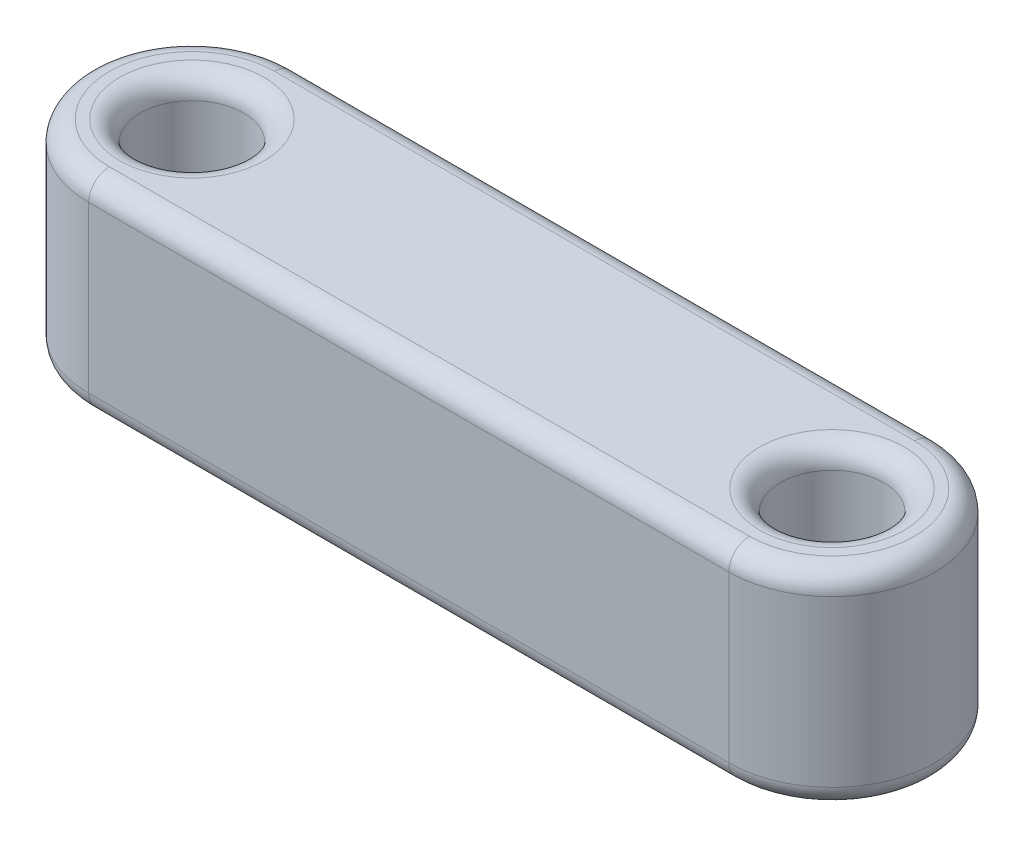
ISO-10303-21;
HEADER;
FILE_DESCRIPTION(('STEP AP214'),'2;1');
FILE_NAME('part.step','',(''),(''),'','','');
FILE_SCHEMA(('AUTOMOTIVE_DESIGN { 1 0 10303 214 1 1 1 1 }'));
ENDSEC;
DATA;
#1=APPLICATION_CONTEXT('core data for automotive mechanical design processes');
#2=APPLICATION_PROTOCOL_DEFINITION('international standard','automotive_design',2000,#1);
#3=PRODUCT_CONTEXT('',#1,'mechanical');
#4=PRODUCT('Part','Part','',(#3));
#5=PRODUCT_RELATED_PRODUCT_CATEGORY('part','',(#4));
#6=PRODUCT_DEFINITION_FORMATION('','',#4);
#7=PRODUCT_DEFINITION_CONTEXT('part definition',#1,'design');
#8=PRODUCT_DEFINITION('design','',#6,#7);
#9=PRODUCT_DEFINITION_SHAPE('','',#8);
#10=(LENGTH_UNIT() NAMED_UNIT(*) SI_UNIT(.MILLI.,.METRE.));
#11=(NAMED_UNIT(*) PLANE_ANGLE_UNIT() SI_UNIT($,.RADIAN.));
#12=(NAMED_UNIT(*) SI_UNIT($,.STERADIAN.) SOLID_ANGLE_UNIT());
#13=UNCERTAINTY_MEASURE_WITH_UNIT(LENGTH_MEASURE(1.E-05),#10,'distance_accuracy_value','');
#14=(GEOMETRIC_REPRESENTATION_CONTEXT(3) GLOBAL_UNCERTAINTY_ASSIGNED_CONTEXT((#13)) GLOBAL_UNIT_ASSIGNED_CONTEXT((#10,
#11,#12)) REPRESENTATION_CONTEXT('',''));
#15=CARTESIAN_POINT('',(0.,0.,0.));
#16=DIRECTION('',(0.,0.,1.));
#17=DIRECTION('',(1.,0.,0.));
#18=AXIS2_PLACEMENT_3D('',#15,#16,#17);
#19=CARTESIAN_POINT('',(0.,10.,0.));
#20=DIRECTION('',(0.,1.,0.));
#21=DIRECTION('',(0.,0.,1.));
#22=AXIS2_PLACEMENT_3D('',#19,#20,#21);
#23=PLANE('',#22);
#24=CARTESIAN_POINT('',(31.,10.,0.));
#25=DIRECTION('',(0.,1.,0.));
#26=DIRECTION('',(0.,0.,1.));
#27=AXIS2_PLACEMENT_3D('',#24,#25,#26);
#28=CIRCLE('',#27,3.5);
#29=CARTESIAN_POINT('',(31.,10.,3.5));
#30=VERTEX_POINT('',#29);
#31=EDGE_CURVE('E11',#30,#30,#28,.F.);
#32=ORIENTED_EDGE('',*,*,#31,.T.);
#33=EDGE_LOOP('',(#32));
#34=FACE_BOUND('',#33,.T.);
#35=CARTESIAN_POINT('',(31.,10.,0.));
#36=DIRECTION('',(0.,1.,0.));
#37=DIRECTION('',(0.,0.,1.));
#38=AXIS2_PLACEMENT_3D('',#35,#36,#37);
#39=CIRCLE('',#38,4.);
#40=CARTESIAN_POINT('',(31.,10.,4.));
#41=VERTEX_POINT('',#40);
#42=CARTESIAN_POINT('',(31.,10.,-4.));
#43=VERTEX_POINT('',#42);
#44=EDGE_CURVE('E57',#41,#43,#39,.T.);
#45=ORIENTED_EDGE('',*,*,#44,.T.);
#46=DIRECTION('',(-1.,0.,0.));
#47=VECTOR('',#46,1.);
#48=CARTESIAN_POINT('',(0.,10.,-4.));
#49=LINE('',#48,#47);
#50=CARTESIAN_POINT('',(0.,10.,-4.));
#51=VERTEX_POINT('',#50);
#52=EDGE_CURVE('E49',#43,#51,#49,.T.);
#53=ORIENTED_EDGE('',*,*,#52,.T.);
#54=CARTESIAN_POINT('',(0.,10.,0.));
#55=DIRECTION('',(0.,1.,0.));
#56=DIRECTION('',(0.,0.,1.));
#57=AXIS2_PLACEMENT_3D('',#54,#55,#56);
#58=CIRCLE('',#57,4.);
#59=CARTESIAN_POINT('',(0.,10.,4.));
#60=VERTEX_POINT('',#59);
#61=EDGE_CURVE('E194',#51,#60,#58,.T.);
#62=ORIENTED_EDGE('',*,*,#61,.T.);
#63=DIRECTION('',(1.,0.,0.));
#64=VECTOR('',#63,1.);
#65=CARTESIAN_POINT('',(31.,10.,4.));
#66=LINE('',#65,#64);
#67=EDGE_CURVE('E62',#60,#41,#66,.T.);
#68=ORIENTED_EDGE('',*,*,#67,.T.);
#69=EDGE_LOOP('',(#45,#53,#62,#68));
#70=FACE_BOUND('',#69,.T.);
#71=CARTESIAN_POINT('',(0.,10.,0.));
#72=DIRECTION('',(0.,1.,0.));
#73=DIRECTION('',(0.,0.,1.));
#74=AXIS2_PLACEMENT_3D('',#71,#72,#73);
#75=CIRCLE('',#74,3.5);
#76=CARTESIAN_POINT('',(0.,10.,3.5));
#77=VERTEX_POINT('',#76);
#78=EDGE_CURVE('E190',#77,#77,#75,.F.);
#79=ORIENTED_EDGE('',*,*,#78,.T.);
#80=EDGE_LOOP('',(#79));
#81=FACE_BOUND('',#80,.T.);
#82=ADVANCED_FACE('F39',(#34,#70,#81),#23,.T.);
#83=CARTESIAN_POINT('',(0.,0.,0.));
#84=DIRECTION('',(0.,1.,0.));
#85=DIRECTION('',(0.,0.,1.));
#86=AXIS2_PLACEMENT_3D('',#83,#84,#85);
#87=PLANE('',#86);
#88=CARTESIAN_POINT('',(31.,0.,0.));
#89=DIRECTION('',(0.,1.,0.));
#90=DIRECTION('',(0.,0.,1.));
#91=AXIS2_PLACEMENT_3D('',#88,#89,#90);
#92=CIRCLE('',#91,3.5);
#93=CARTESIAN_POINT('',(31.,0.,3.5));
#94=VERTEX_POINT('',#93);
#95=EDGE_CURVE('E142',#94,#94,#92,.T.);
#96=ORIENTED_EDGE('',*,*,#95,.T.);
#97=EDGE_LOOP('',(#96));
#98=FACE_BOUND('',#97,.T.);
#99=CARTESIAN_POINT('',(0.,0.,0.));
#100=DIRECTION('',(0.,1.,0.));
#101=DIRECTION('',(0.,0.,1.));
#102=AXIS2_PLACEMENT_3D('',#99,#100,#101);
#103=CIRCLE('',#102,3.5);
#104=CARTESIAN_POINT('',(0.,0.,3.5));
#105=VERTEX_POINT('',#104);
#106=EDGE_CURVE('E137',#105,#105,#103,.T.);
#107=ORIENTED_EDGE('',*,*,#106,.T.);
#108=EDGE_LOOP('',(#107));
#109=FACE_BOUND('',#108,.T.);
#110=CARTESIAN_POINT('',(31.,0.,0.));
#111=DIRECTION('',(0.,1.,0.));
#112=DIRECTION('',(0.,0.,1.));
#113=AXIS2_PLACEMENT_3D('',#110,#111,#112);
#114=CIRCLE('',#113,4.);
#115=CARTESIAN_POINT('',(31.,0.,-4.));
#116=VERTEX_POINT('',#115);
#117=CARTESIAN_POINT('',(31.,0.,4.));
#118=VERTEX_POINT('',#117);
#119=EDGE_CURVE('E135',#116,#118,#114,.F.);
#120=ORIENTED_EDGE('',*,*,#119,.T.);
#121=DIRECTION('',(1.,0.,0.));
#122=VECTOR('',#121,1.);
#123=CARTESIAN_POINT('',(0.,0.,4.));
#124=LINE('',#123,#122);
#125=CARTESIAN_POINT('',(0.,0.,4.));
#126=VERTEX_POINT('',#125);
#127=EDGE_CURVE('E112',#118,#126,#124,.F.);
#128=ORIENTED_EDGE('',*,*,#127,.T.);
#129=CARTESIAN_POINT('',(0.,0.,0.));
#130=DIRECTION('',(0.,1.,0.));
#131=DIRECTION('',(0.,0.,1.));
#132=AXIS2_PLACEMENT_3D('',#129,#130,#131);
#133=CIRCLE('',#132,4.);
#134=CARTESIAN_POINT('',(0.,0.,-4.));
#135=VERTEX_POINT('',#134);
#136=EDGE_CURVE('E123',#126,#135,#133,.F.);
#137=ORIENTED_EDGE('',*,*,#136,.T.);
#138=DIRECTION('',(-1.,0.,0.));
#139=VECTOR('',#138,1.);
#140=CARTESIAN_POINT('',(0.,0.,-4.));
#141=LINE('',#140,#139);
#142=EDGE_CURVE('E130',#135,#116,#141,.F.);
#143=ORIENTED_EDGE('',*,*,#142,.T.);
#144=EDGE_LOOP('',(#120,#128,#137,#143));
#145=FACE_BOUND('',#144,.T.);
#146=ADVANCED_FACE('F133',(#98,#109,#145),#87,.F.);
#147=CARTESIAN_POINT('',(0.,10.,0.));
#148=DIRECTION('',(0.,-1.,0.));
#149=DIRECTION('',(0.,0.,-1.));
#150=AXIS2_PLACEMENT_3D('',#147,#148,#149);
#151=CYLINDRICAL_SURFACE('',#150,5.);
#152=DIRECTION('',(0.,-1.,0.));
#153=VECTOR('',#152,1.);
#154=CARTESIAN_POINT('',(0.,10.,-5.));
#155=LINE('',#154,#153);
#156=CARTESIAN_POINT('',(0.,9.,-5.));
#157=VERTEX_POINT('',#156);
#158=CARTESIAN_POINT('',(0.,0.999999999999999,-5.));
#159=VERTEX_POINT('',#158);
#160=EDGE_CURVE('E210',#157,#159,#155,.T.);
#161=ORIENTED_EDGE('',*,*,#160,.T.);
#162=CARTESIAN_POINT('',(0.,0.999999999999999,0.));
#163=DIRECTION('',(0.,1.,0.));
#164=DIRECTION('',(0.,0.,1.));
#165=AXIS2_PLACEMENT_3D('',#162,#163,#164);
#166=CIRCLE('',#165,5.);
#167=CARTESIAN_POINT('',(0.,0.999999999999999,5.));
#168=VERTEX_POINT('',#167);
#169=EDGE_CURVE('E187',#159,#168,#166,.T.);
#170=ORIENTED_EDGE('',*,*,#169,.T.);
#171=DIRECTION('',(0.,-1.,0.));
#172=VECTOR('',#171,1.);
#173=CARTESIAN_POINT('',(0.,10.,5.));
#174=LINE('',#173,#172);
#175=CARTESIAN_POINT('',(0.,9.,5.));
#176=VERTEX_POINT('',#175);
#177=EDGE_CURVE('E131',#176,#168,#174,.T.);
#178=ORIENTED_EDGE('',*,*,#177,.F.);
#179=CARTESIAN_POINT('',(0.,9.,0.));
#180=DIRECTION('',(0.,1.,0.));
#181=DIRECTION('',(0.,0.,1.));
#182=AXIS2_PLACEMENT_3D('',#179,#180,#181);
#183=CIRCLE('',#182,5.);
#184=EDGE_CURVE('E184',#176,#157,#183,.F.);
#185=ORIENTED_EDGE('',*,*,#184,.T.);
#186=EDGE_LOOP('',(#161,#170,#178,#185));
#187=FACE_BOUND('',#186,.T.);
#188=ADVANCED_FACE('F240',(#187),#151,.T.);
#189=CARTESIAN_POINT('',(0.,10.,5.));
#190=DIRECTION('',(0.,0.,-1.));
#191=DIRECTION('',(-1.,0.,0.));
#192=AXIS2_PLACEMENT_3D('',#189,#190,#191);
#193=PLANE('',#192);
#194=ORIENTED_EDGE('',*,*,#177,.T.);
#195=DIRECTION('',(1.,0.,0.));
#196=VECTOR('',#195,1.);
#197=CARTESIAN_POINT('',(0.,0.999999999999999,5.));
#198=LINE('',#197,#196);
#199=CARTESIAN_POINT('',(31.,0.999999999999999,5.));
#200=VERTEX_POINT('',#199);
#201=EDGE_CURVE('E115',#168,#200,#198,.T.);
#202=ORIENTED_EDGE('',*,*,#201,.T.);
#203=DIRECTION('',(0.,-1.,0.));
#204=VECTOR('',#203,1.);
#205=CARTESIAN_POINT('',(31.,10.,5.));
#206=LINE('',#205,#204);
#207=CARTESIAN_POINT('',(31.,9.,5.));
#208=VERTEX_POINT('',#207);
#209=EDGE_CURVE('E237',#208,#200,#206,.T.);
#210=ORIENTED_EDGE('',*,*,#209,.F.);
#211=DIRECTION('',(1.,0.,0.));
#212=VECTOR('',#211,1.);
#213=CARTESIAN_POINT('',(0.,9.,5.));
#214=LINE('',#213,#212);
#215=EDGE_CURVE('E166',#208,#176,#214,.F.);
#216=ORIENTED_EDGE('',*,*,#215,.T.);
#217=EDGE_LOOP('',(#194,#202,#210,#216));
#218=FACE_BOUND('',#217,.T.);
#219=ADVANCED_FACE('F235',(#218),#193,.F.);
#220=CARTESIAN_POINT('',(31.,10.,0.));
#221=DIRECTION('',(0.,-1.,0.));
#222=DIRECTION('',(0.,0.,-1.));
#223=AXIS2_PLACEMENT_3D('',#220,#221,#222);
#224=CYLINDRICAL_SURFACE('',#223,5.);
#225=ORIENTED_EDGE('',*,*,#209,.T.);
#226=CARTESIAN_POINT('',(31.,0.999999999999999,0.));
#227=DIRECTION('',(0.,1.,0.));
#228=DIRECTION('',(0.,0.,1.));
#229=AXIS2_PLACEMENT_3D('',#226,#227,#228);
#230=CIRCLE('',#229,5.);
#231=CARTESIAN_POINT('',(31.,0.999999999999999,-5.));
#232=VERTEX_POINT('',#231);
#233=EDGE_CURVE('E174',#200,#232,#230,.T.);
#234=ORIENTED_EDGE('',*,*,#233,.T.);
#235=DIRECTION('',(0.,-1.,0.));
#236=VECTOR('',#235,1.);
#237=CARTESIAN_POINT('',(31.,10.,-5.));
#238=LINE('',#237,#236);
#239=CARTESIAN_POINT('',(31.,9.,-5.));
#240=VERTEX_POINT('',#239);
#241=EDGE_CURVE('E245',#240,#232,#238,.T.);
#242=ORIENTED_EDGE('',*,*,#241,.F.);
#243=CARTESIAN_POINT('',(31.,9.,0.));
#244=DIRECTION('',(0.,1.,0.));
#245=DIRECTION('',(0.,0.,1.));
#246=AXIS2_PLACEMENT_3D('',#243,#244,#245);
#247=CIRCLE('',#246,5.);
#248=EDGE_CURVE('E171',#240,#208,#247,.F.);
#249=ORIENTED_EDGE('',*,*,#248,.T.);
#250=EDGE_LOOP('',(#225,#234,#242,#249));
#251=FACE_BOUND('',#250,.T.);
#252=ADVANCED_FACE('F259',(#251),#224,.T.);
#253=CARTESIAN_POINT('',(0.,10.,-5.));
#254=DIRECTION('',(0.,0.,1.));
#255=DIRECTION('',(1.,0.,0.));
#256=AXIS2_PLACEMENT_3D('',#253,#254,#255);
#257=PLANE('',#256);
#258=ORIENTED_EDGE('',*,*,#241,.T.);
#259=DIRECTION('',(-1.,0.,0.));
#260=VECTOR('',#259,1.);
#261=CARTESIAN_POINT('',(0.,0.999999999999999,-5.));
#262=LINE('',#261,#260);
#263=EDGE_CURVE('E181',#232,#159,#262,.T.);
#264=ORIENTED_EDGE('',*,*,#263,.T.);
#265=ORIENTED_EDGE('',*,*,#160,.F.);
#266=DIRECTION('',(-1.,0.,0.));
#267=VECTOR('',#266,1.);
#268=CARTESIAN_POINT('',(31.,9.,-5.));
#269=LINE('',#268,#267);
#270=EDGE_CURVE('E177',#157,#240,#269,.F.);
#271=ORIENTED_EDGE('',*,*,#270,.T.);
#272=EDGE_LOOP('',(#258,#264,#265,#271));
#273=FACE_BOUND('',#272,.T.);
#274=ADVANCED_FACE('F265',(#273),#257,.F.);
#275=CARTESIAN_POINT('',(0.,10.,0.));
#276=DIRECTION('',(0.,-1.,0.));
#277=DIRECTION('',(0.,0.,-1.));
#278=AXIS2_PLACEMENT_3D('',#275,#276,#277);
#279=CYLINDRICAL_SURFACE('',#278,2.5);
#280=CARTESIAN_POINT('',(0.,0.999999999999999,0.));
#281=DIRECTION('',(0.,1.,0.));
#282=DIRECTION('',(0.,0.,1.));
#283=AXIS2_PLACEMENT_3D('',#280,#281,#282);
#284=CIRCLE('',#283,2.5);
#285=CARTESIAN_POINT('',(0.,0.999999999999999,2.5));
#286=VERTEX_POINT('',#285);
#287=EDGE_CURVE('E162',#286,#286,#284,.F.);
#288=ORIENTED_EDGE('',*,*,#287,.T.);
#289=EDGE_LOOP('',(#288));
#290=FACE_BOUND('',#289,.T.);
#291=CARTESIAN_POINT('',(0.,9.,0.));
#292=DIRECTION('',(0.,1.,0.));
#293=DIRECTION('',(0.,0.,1.));
#294=AXIS2_PLACEMENT_3D('',#291,#292,#293);
#295=CIRCLE('',#294,2.5);
#296=CARTESIAN_POINT('',(0.,9.,2.5));
#297=VERTEX_POINT('',#296);
#298=EDGE_CURVE('E158',#297,#297,#295,.T.);
#299=ORIENTED_EDGE('',*,*,#298,.T.);
#300=EDGE_LOOP('',(#299));
#301=FACE_BOUND('',#300,.T.);
#302=ADVANCED_FACE('F281',(#290,#301),#279,.F.);
#303=CARTESIAN_POINT('',(31.,10.,0.));
#304=DIRECTION('',(0.,-1.,0.));
#305=DIRECTION('',(0.,0.,-1.));
#306=AXIS2_PLACEMENT_3D('',#303,#304,#305);
#307=CYLINDRICAL_SURFACE('',#306,2.5);
#308=CARTESIAN_POINT('',(31.,0.999999999999999,0.));
#309=DIRECTION('',(0.,1.,0.));
#310=DIRECTION('',(0.,0.,1.));
#311=AXIS2_PLACEMENT_3D('',#308,#309,#310);
#312=CIRCLE('',#311,2.5);
#313=CARTESIAN_POINT('',(31.,0.999999999999999,2.5));
#314=VERTEX_POINT('',#313);
#315=EDGE_CURVE('E154',#314,#314,#312,.F.);
#316=ORIENTED_EDGE('',*,*,#315,.T.);
#317=EDGE_LOOP('',(#316));
#318=FACE_BOUND('',#317,.T.);
#319=CARTESIAN_POINT('',(31.,9.,0.));
#320=DIRECTION('',(0.,1.,0.));
#321=DIRECTION('',(0.,0.,1.));
#322=AXIS2_PLACEMENT_3D('',#319,#320,#321);
#323=CIRCLE('',#322,2.5);
#324=CARTESIAN_POINT('',(31.,9.,2.5));
#325=VERTEX_POINT('',#324);
#326=EDGE_CURVE('E150',#325,#325,#323,.T.);
#327=ORIENTED_EDGE('',*,*,#326,.T.);
#328=EDGE_LOOP('',(#327));
#329=FACE_BOUND('',#328,.T.);
#330=ADVANCED_FACE('F283',(#318,#329),#307,.F.);
#331=CARTESIAN_POINT('',(31.,0.999999999999999,0.));
#332=DIRECTION('',(0.,1.,0.));
#333=DIRECTION('',(0.,0.,1.));
#334=AXIS2_PLACEMENT_3D('',#331,#332,#333);
#335=TOROIDAL_SURFACE('',#334,3.5,1.);
#336=ORIENTED_EDGE('',*,*,#315,.F.);
#337=EDGE_LOOP('',(#336));
#338=FACE_BOUND('',#337,.T.);
#339=ORIENTED_EDGE('',*,*,#95,.F.);
#340=EDGE_LOOP('',(#339));
#341=FACE_BOUND('',#340,.T.);
#342=ADVANCED_FACE('F290',(#338,#341),#335,.T.);
#343=CARTESIAN_POINT('',(0.,0.999999999999999,0.));
#344=DIRECTION('',(0.,1.,0.));
#345=DIRECTION('',(0.,0.,1.));
#346=AXIS2_PLACEMENT_3D('',#343,#344,#345);
#347=TOROIDAL_SURFACE('',#346,3.5,1.);
#348=ORIENTED_EDGE('',*,*,#287,.F.);
#349=EDGE_LOOP('',(#348));
#350=FACE_BOUND('',#349,.T.);
#351=ORIENTED_EDGE('',*,*,#106,.F.);
#352=EDGE_LOOP('',(#351));
#353=FACE_BOUND('',#352,.T.);
#354=ADVANCED_FACE('F306',(#350,#353),#347,.T.);
#355=CARTESIAN_POINT('',(0.,0.999999999999999,-4.));
#356=DIRECTION('',(-1.,0.,0.));
#357=DIRECTION('',(0.,0.,1.));
#358=AXIS2_PLACEMENT_3D('',#355,#356,#357);
#359=CYLINDRICAL_SURFACE('',#358,1.);
#360=CARTESIAN_POINT('',(31.,1.,-4.));
#361=DIRECTION('',(1.,0.,0.));
#362=DIRECTION('',(0.,0.,-1.));
#363=AXIS2_PLACEMENT_3D('',#360,#361,#362);
#364=CIRCLE('',#363,1.);
#365=EDGE_CURVE('E119',#116,#232,#364,.T.);
#366=ORIENTED_EDGE('',*,*,#365,.F.);
#367=ORIENTED_EDGE('',*,*,#142,.F.);
#368=CARTESIAN_POINT('',(0.,0.999999999999999,-4.));
#369=DIRECTION('',(-1.,0.,0.));
#370=DIRECTION('',(0.,0.,1.));
#371=AXIS2_PLACEMENT_3D('',#368,#369,#370);
#372=CIRCLE('',#371,1.);
#373=EDGE_CURVE('E126',#159,#135,#372,.T.);
#374=ORIENTED_EDGE('',*,*,#373,.F.);
#375=ORIENTED_EDGE('',*,*,#263,.F.);
#376=EDGE_LOOP('',(#366,#367,#374,#375));
#377=FACE_BOUND('',#376,.T.);
#378=ADVANCED_FACE('F252',(#377),#359,.T.);
#379=CARTESIAN_POINT('',(0.,0.999999999999999,0.));
#380=DIRECTION('',(0.,1.,0.));
#381=DIRECTION('',(0.,0.,1.));
#382=AXIS2_PLACEMENT_3D('',#379,#380,#381);
#383=TOROIDAL_SURFACE('',#382,4.,1.);
#384=ORIENTED_EDGE('',*,*,#373,.T.);
#385=ORIENTED_EDGE('',*,*,#136,.F.);
#386=CARTESIAN_POINT('',(0.,0.999999999999999,4.));
#387=DIRECTION('',(1.,0.,0.));
#388=DIRECTION('',(0.,0.,-1.));
#389=AXIS2_PLACEMENT_3D('',#386,#387,#388);
#390=CIRCLE('',#389,1.);
#391=EDGE_CURVE('E108',#168,#126,#390,.T.);
#392=ORIENTED_EDGE('',*,*,#391,.F.);
#393=ORIENTED_EDGE('',*,*,#169,.F.);
#394=EDGE_LOOP('',(#384,#385,#392,#393));
#395=FACE_BOUND('',#394,.T.);
#396=ADVANCED_FACE('F124',(#395),#383,.T.);
#397=CARTESIAN_POINT('',(31.,0.999999999999999,0.));
#398=DIRECTION('',(0.,1.,0.));
#399=DIRECTION('',(0.,0.,1.));
#400=AXIS2_PLACEMENT_3D('',#397,#398,#399);
#401=TOROIDAL_SURFACE('',#400,4.,1.);
#402=ORIENTED_EDGE('',*,*,#365,.T.);
#403=ORIENTED_EDGE('',*,*,#233,.F.);
#404=CARTESIAN_POINT('',(31.,1.,4.));
#405=DIRECTION('',(-1.,0.,0.));
#406=DIRECTION('',(0.,0.,1.));
#407=AXIS2_PLACEMENT_3D('',#404,#405,#406);
#408=CIRCLE('',#407,1.);
#409=EDGE_CURVE('E120',#118,#200,#408,.T.);
#410=ORIENTED_EDGE('',*,*,#409,.F.);
#411=ORIENTED_EDGE('',*,*,#119,.F.);
#412=EDGE_LOOP('',(#402,#403,#410,#411));
#413=FACE_BOUND('',#412,.T.);
#414=ADVANCED_FACE('F255',(#413),#401,.T.);
#415=CARTESIAN_POINT('',(0.,0.999999999999999,4.));
#416=DIRECTION('',(1.,0.,0.));
#417=DIRECTION('',(0.,0.,-1.));
#418=AXIS2_PLACEMENT_3D('',#415,#416,#417);
#419=CYLINDRICAL_SURFACE('',#418,1.);
#420=ORIENTED_EDGE('',*,*,#391,.T.);
#421=ORIENTED_EDGE('',*,*,#127,.F.);
#422=ORIENTED_EDGE('',*,*,#409,.T.);
#423=ORIENTED_EDGE('',*,*,#201,.F.);
#424=EDGE_LOOP('',(#420,#421,#422,#423));
#425=FACE_BOUND('',#424,.T.);
#426=ADVANCED_FACE('F110',(#425),#419,.T.);
#427=CARTESIAN_POINT('',(31.,9.,0.));
#428=DIRECTION('',(0.,1.,0.));
#429=DIRECTION('',(0.,0.,1.));
#430=AXIS2_PLACEMENT_3D('',#427,#428,#429);
#431=TOROIDAL_SURFACE('',#430,3.5,1.);
#432=ORIENTED_EDGE('',*,*,#31,.F.);
#433=EDGE_LOOP('',(#432));
#434=FACE_BOUND('',#433,.T.);
#435=ORIENTED_EDGE('',*,*,#326,.F.);
#436=EDGE_LOOP('',(#435));
#437=FACE_BOUND('',#436,.T.);
#438=ADVANCED_FACE('F313',(#434,#437),#431,.T.);
#439=CARTESIAN_POINT('',(0.,9.,4.));
#440=DIRECTION('',(-1.,0.,0.));
#441=DIRECTION('',(0.,0.,1.));
#442=AXIS2_PLACEMENT_3D('',#439,#440,#441);
#443=CYLINDRICAL_SURFACE('',#442,1.);
#444=CARTESIAN_POINT('',(0.,9.,4.));
#445=DIRECTION('',(-1.,0.,0.));
#446=DIRECTION('',(0.,0.,1.));
#447=AXIS2_PLACEMENT_3D('',#444,#445,#446);
#448=CIRCLE('',#447,1.);
#449=EDGE_CURVE('E216',#176,#60,#448,.T.);
#450=ORIENTED_EDGE('',*,*,#449,.F.);
#451=ORIENTED_EDGE('',*,*,#215,.F.);
#452=CARTESIAN_POINT('',(31.,9.,4.));
#453=DIRECTION('',(1.,0.,0.));
#454=DIRECTION('',(0.,0.,-1.));
#455=AXIS2_PLACEMENT_3D('',#452,#453,#454);
#456=CIRCLE('',#455,1.);
#457=EDGE_CURVE('E43',#41,#208,#456,.T.);
#458=ORIENTED_EDGE('',*,*,#457,.F.);
#459=ORIENTED_EDGE('',*,*,#67,.F.);
#460=EDGE_LOOP('',(#450,#451,#458,#459));
#461=FACE_BOUND('',#460,.T.);
#462=ADVANCED_FACE('F230',(#461),#443,.T.);
#463=CARTESIAN_POINT('',(31.,9.,0.));
#464=DIRECTION('',(0.,1.,0.));
#465=DIRECTION('',(0.,0.,1.));
#466=AXIS2_PLACEMENT_3D('',#463,#464,#465);
#467=TOROIDAL_SURFACE('',#466,4.,1.);
#468=ORIENTED_EDGE('',*,*,#457,.T.);
#469=ORIENTED_EDGE('',*,*,#248,.F.);
#470=CARTESIAN_POINT('',(31.,9.,-4.));
#471=DIRECTION('',(-1.,0.,0.));
#472=DIRECTION('',(0.,0.,1.));
#473=AXIS2_PLACEMENT_3D('',#470,#471,#472);
#474=CIRCLE('',#473,1.);
#475=EDGE_CURVE('E214',#43,#240,#474,.T.);
#476=ORIENTED_EDGE('',*,*,#475,.F.);
#477=ORIENTED_EDGE('',*,*,#44,.F.);
#478=EDGE_LOOP('',(#468,#469,#476,#477));
#479=FACE_BOUND('',#478,.T.);
#480=ADVANCED_FACE('F227',(#479),#467,.T.);
#481=CARTESIAN_POINT('',(0.,9.,0.));
#482=DIRECTION('',(0.,1.,0.));
#483=DIRECTION('',(0.,0.,1.));
#484=AXIS2_PLACEMENT_3D('',#481,#482,#483);
#485=TOROIDAL_SURFACE('',#484,4.,1.);
#486=ORIENTED_EDGE('',*,*,#449,.T.);
#487=ORIENTED_EDGE('',*,*,#61,.F.);
#488=CARTESIAN_POINT('',(0.,9.,-4.));
#489=DIRECTION('',(1.,0.,0.));
#490=DIRECTION('',(0.,0.,-1.));
#491=AXIS2_PLACEMENT_3D('',#488,#489,#490);
#492=CIRCLE('',#491,1.);
#493=EDGE_CURVE('E211',#157,#51,#492,.T.);
#494=ORIENTED_EDGE('',*,*,#493,.F.);
#495=ORIENTED_EDGE('',*,*,#184,.F.);
#496=EDGE_LOOP('',(#486,#487,#494,#495));
#497=FACE_BOUND('',#496,.T.);
#498=ADVANCED_FACE('F270',(#497),#485,.T.);
#499=CARTESIAN_POINT('',(0.,9.,-4.));
#500=DIRECTION('',(1.,0.,0.));
#501=DIRECTION('',(0.,0.,-1.));
#502=AXIS2_PLACEMENT_3D('',#499,#500,#501);
#503=CYLINDRICAL_SURFACE('',#502,1.);
#504=ORIENTED_EDGE('',*,*,#475,.T.);
#505=ORIENTED_EDGE('',*,*,#270,.F.);
#506=ORIENTED_EDGE('',*,*,#493,.T.);
#507=ORIENTED_EDGE('',*,*,#52,.F.);
#508=EDGE_LOOP('',(#504,#505,#506,#507));
#509=FACE_BOUND('',#508,.T.);
#510=ADVANCED_FACE('F268',(#509),#503,.T.);
#511=CARTESIAN_POINT('',(0.,9.,0.));
#512=DIRECTION('',(0.,1.,0.));
#513=DIRECTION('',(0.,0.,1.));
#514=AXIS2_PLACEMENT_3D('',#511,#512,#513);
#515=TOROIDAL_SURFACE('',#514,3.5,1.);
#516=ORIENTED_EDGE('',*,*,#78,.F.);
#517=EDGE_LOOP('',(#516));
#518=FACE_BOUND('',#517,.T.);
#519=ORIENTED_EDGE('',*,*,#298,.F.);
#520=EDGE_LOOP('',(#519));
#521=FACE_BOUND('',#520,.T.);
#522=ADVANCED_FACE('F41',(#518,#521),#515,.T.);
#523=CLOSED_SHELL('',(#82,#146,#188,#219,#252,#274,#302,#330,#342,#354,#378,#396,#414,#426,#438,
#462,#480,#498,#510,#522));
#524=MANIFOLD_SOLID_BREP('B2',#523);
#525=ADVANCED_BREP_SHAPE_REPRESENTATION('',(#18,#524),#14);
#526=SHAPE_DEFINITION_REPRESENTATION(#9,#525);
ENDSEC;
END-ISO-10303-21;
